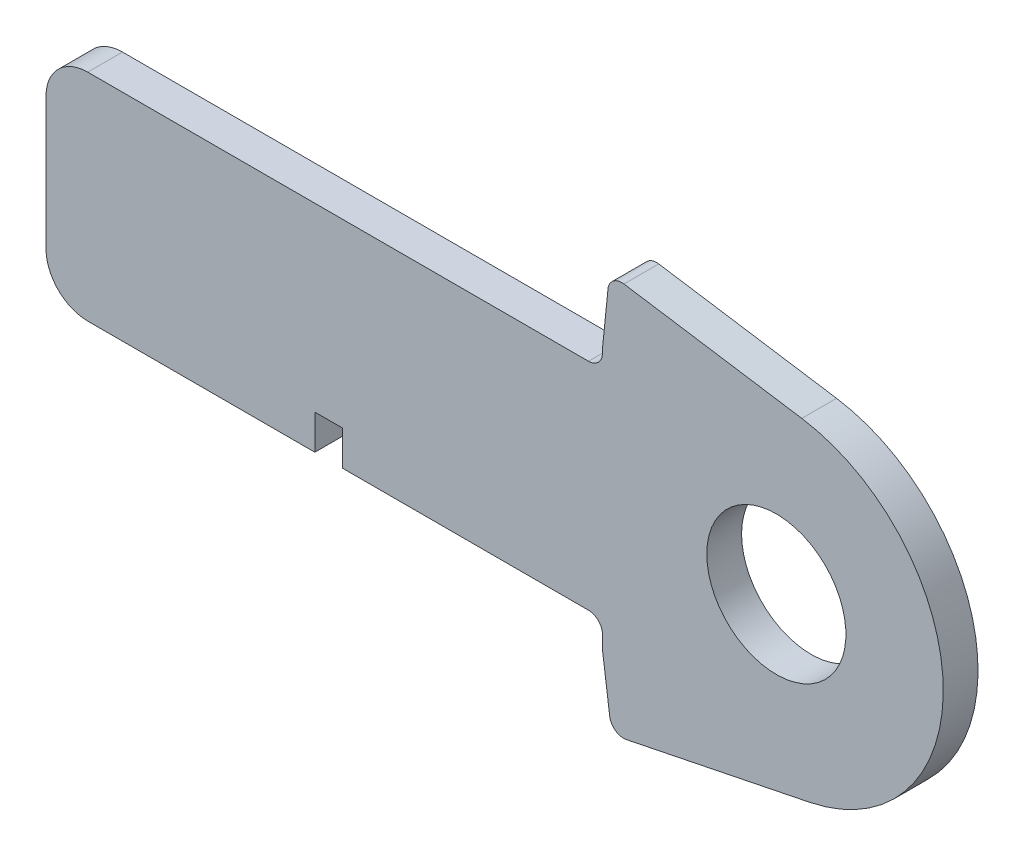
ISO-10303-21;
HEADER;
FILE_DESCRIPTION(('STEP AP214'),'2;1');
FILE_NAME('part.step','',(''),(''),'','','');
FILE_SCHEMA(('AUTOMOTIVE_DESIGN { 1 0 10303 214 1 1 1 1 }'));
ENDSEC;
DATA;
#1=APPLICATION_CONTEXT('core data for automotive mechanical design processes');
#2=APPLICATION_PROTOCOL_DEFINITION('international standard','automotive_design',2000,#1);
#3=PRODUCT_CONTEXT('',#1,'mechanical');
#4=PRODUCT('Part','Part','',(#3));
#5=PRODUCT_RELATED_PRODUCT_CATEGORY('part','',(#4));
#6=PRODUCT_DEFINITION_FORMATION('','',#4);
#7=PRODUCT_DEFINITION_CONTEXT('part definition',#1,'design');
#8=PRODUCT_DEFINITION('design','',#6,#7);
#9=PRODUCT_DEFINITION_SHAPE('','',#8);
#10=(LENGTH_UNIT() NAMED_UNIT(*) SI_UNIT(.MILLI.,.METRE.));
#11=(NAMED_UNIT(*) PLANE_ANGLE_UNIT() SI_UNIT($,.RADIAN.));
#12=(NAMED_UNIT(*) SI_UNIT($,.STERADIAN.) SOLID_ANGLE_UNIT());
#13=UNCERTAINTY_MEASURE_WITH_UNIT(LENGTH_MEASURE(1.E-05),#10,'distance_accuracy_value','');
#14=(GEOMETRIC_REPRESENTATION_CONTEXT(3) GLOBAL_UNCERTAINTY_ASSIGNED_CONTEXT((#13)) GLOBAL_UNIT_ASSIGNED_CONTEXT((#10,
#11,#12)) REPRESENTATION_CONTEXT('',''));
#15=CARTESIAN_POINT('',(0.,0.,0.));
#16=DIRECTION('',(0.,0.,1.));
#17=DIRECTION('',(1.,0.,0.));
#18=AXIS2_PLACEMENT_3D('',#15,#16,#17);
#19=CARTESIAN_POINT('',(213.422580288689,54.7287513036553,3.175));
#20=DIRECTION('',(0.,0.,-1.));
#21=DIRECTION('',(-1.,0.,0.));
#22=AXIS2_PLACEMENT_3D('',#19,#20,#21);
#23=PLANE('',#22);
#24=CARTESIAN_POINT('',(292.383806587551,26.255421434861,3.175));
#25=DIRECTION('',(0.,0.,-1.));
#26=DIRECTION('',(-1.,0.,0.));
#27=AXIS2_PLACEMENT_3D('',#24,#25,#26);
#28=CIRCLE('',#27,6.35);
#29=CARTESIAN_POINT('',(286.033806587551,26.255421434861,3.175));
#30=VERTEX_POINT('',#29);
#31=EDGE_CURVE('E281',#30,#30,#28,.T.);
#32=ORIENTED_EDGE('',*,*,#31,.T.);
#33=EDGE_LOOP('',(#32));
#34=FACE_BOUND('',#33,.T.);
#35=DIRECTION('',(-0.133331034869946,0.991071559041278,0.));
#36=VECTOR('',#35,1.);
#37=CARTESIAN_POINT('',(273.434595269181,36.7857570161253,3.175));
#38=LINE('',#37,#36);
#39=CARTESIAN_POINT('',(277.174368657139,8.98740499943636,3.175));
#40=VERTEX_POINT('',#39);
#41=CARTESIAN_POINT('',(276.508806587551,13.9346375667709,3.175));
#42=VERTEX_POINT('',#41);
#43=EDGE_CURVE('E232',#40,#42,#38,.T.);
#44=ORIENTED_EDGE('',*,*,#43,.F.);
#45=CARTESIAN_POINT('',(278.433029537121,9.15673541372118,3.175));
#46=DIRECTION('',(0.,0.,-1.));
#47=DIRECTION('',(-1.,0.,0.));
#48=AXIS2_PLACEMENT_3D('',#45,#46,#47);
#49=CIRCLE('',#48,1.27);
#50=CARTESIAN_POINT('',(278.686524593638,7.91229165994138,3.175));
#51=VERTEX_POINT('',#50);
#52=EDGE_CURVE('E307',#40,#51,#49,.F.);
#53=ORIENTED_EDGE('',*,*,#52,.T.);
#54=DIRECTION('',(0.979876971480177,0.199602406706023,0.));
#55=VECTOR('',#54,1.);
#56=CARTESIAN_POINT('',(9.55565157305778,-46.9100702664279,3.175));
#57=LINE('',#56,#55);
#58=CARTESIAN_POINT('',(295.425747265751,11.3220963895031,3.175));
#59=VERTEX_POINT('',#58);
#60=EDGE_CURVE('E230',#51,#59,#57,.T.);
#61=ORIENTED_EDGE('',*,*,#60,.T.);
#62=CARTESIAN_POINT('',(292.383806587551,26.255421434861,3.175));
#63=DIRECTION('',(0.,0.,1.));
#64=DIRECTION('',(1.,0.,0.));
#65=AXIS2_PLACEMENT_3D('',#62,#63,#64);
#66=CIRCLE('',#65,15.24);
#67=CARTESIAN_POINT('',(294.709258182036,41.3169577071576,3.175));
#68=VERTEX_POINT('',#67);
#69=EDGE_CURVE('E258',#59,#68,#66,.T.);
#70=ORIENTED_EDGE('',*,*,#69,.T.);
#71=DIRECTION('',(0.988289781646758,-0.152588687302186,0.));
#72=VECTOR('',#71,1.);
#73=CARTESIAN_POINT('',(13.0924795434369,84.7976608093711,3.175));
#74=LINE('',#73,#72);
#75=CARTESIAN_POINT('',(278.470624311763,43.824149293938,3.175));
#76=VERTEX_POINT('',#75);
#77=EDGE_CURVE('E256',#76,#68,#74,.T.);
#78=ORIENTED_EDGE('',*,*,#77,.F.);
#79=CARTESIAN_POINT('',(278.27683667889,42.5690212712466,3.175));
#80=DIRECTION('',(0.,0.,-1.));
#81=DIRECTION('',(-1.,0.,0.));
#82=AXIS2_PLACEMENT_3D('',#79,#80,#81);
#83=CIRCLE('',#82,1.27);
#84=CARTESIAN_POINT('',(277.013295568393,42.6969425833287,3.175));
#85=VERTEX_POINT('',#84);
#86=EDGE_CURVE('E305',#76,#85,#83,.F.);
#87=ORIENTED_EDGE('',*,*,#86,.T.);
#88=DIRECTION('',(0.10072544258434,0.994914260233609,0.));
#89=VECTOR('',#88,1.);
#90=CARTESIAN_POINT('',(269.924029023359,-27.3271962964349,3.175));
#91=LINE('',#90,#89);
#92=CARTESIAN_POINT('',(276.508806587551,37.7138591806421,3.175));
#93=VERTEX_POINT('',#92);
#94=EDGE_CURVE('E253',#93,#85,#91,.T.);
#95=ORIENTED_EDGE('',*,*,#94,.F.);
#96=DIRECTION('',(0.,1.,0.));
#97=VECTOR('',#96,1.);
#98=CARTESIAN_POINT('',(276.508806587551,0.,3.175));
#99=LINE('',#98,#97);
#100=CARTESIAN_POINT('',(276.508806587551,37.367921434861,3.175));
#101=VERTEX_POINT('',#100);
#102=EDGE_CURVE('E236',#101,#93,#99,.T.);
#103=ORIENTED_EDGE('',*,*,#102,.F.);
#104=CARTESIAN_POINT('',(275.238806587551,37.367921434861,3.175));
#105=DIRECTION('',(0.,0.,-1.));
#106=DIRECTION('',(-1.,0.,0.));
#107=AXIS2_PLACEMENT_3D('',#104,#105,#106);
#108=CIRCLE('',#107,1.27);
#109=CARTESIAN_POINT('',(275.238806587551,36.097921434861,3.175));
#110=VERTEX_POINT('',#109);
#111=EDGE_CURVE('E46',#101,#110,#108,.T.);
#112=ORIENTED_EDGE('',*,*,#111,.T.);
#113=DIRECTION('',(1.,0.,0.));
#114=VECTOR('',#113,1.);
#115=CARTESIAN_POINT('',(0.,36.097921434861,3.175));
#116=LINE('',#115,#114);
#117=CARTESIAN_POINT('',(229.518806587551,36.097921434861,3.175));
#118=VERTEX_POINT('',#117);
#119=EDGE_CURVE('E250',#118,#110,#116,.T.);
#120=ORIENTED_EDGE('',*,*,#119,.F.);
#121=CARTESIAN_POINT('',(229.518806587551,32.287921434861,3.175));
#122=DIRECTION('',(0.,0.,-1.));
#123=DIRECTION('',(-1.,0.,0.));
#124=AXIS2_PLACEMENT_3D('',#121,#122,#123);
#125=CIRCLE('',#124,3.81);
#126=CARTESIAN_POINT('',(225.708806587551,32.287921434861,3.175));
#127=VERTEX_POINT('',#126);
#128=EDGE_CURVE('E289',#118,#127,#125,.F.);
#129=ORIENTED_EDGE('',*,*,#128,.T.);
#130=DIRECTION('',(0.,-1.,0.));
#131=VECTOR('',#130,1.);
#132=CARTESIAN_POINT('',(225.708806587551,0.,3.175));
#133=LINE('',#132,#131);
#134=CARTESIAN_POINT('',(225.708806587551,20.222921434861,3.175));
#135=VERTEX_POINT('',#134);
#136=EDGE_CURVE('E247',#127,#135,#133,.T.);
#137=ORIENTED_EDGE('',*,*,#136,.T.);
#138=CARTESIAN_POINT('',(229.518806587551,20.222921434861,3.175));
#139=DIRECTION('',(0.,0.,-1.));
#140=DIRECTION('',(-1.,0.,0.));
#141=AXIS2_PLACEMENT_3D('',#138,#139,#140);
#142=CIRCLE('',#141,3.81);
#143=CARTESIAN_POINT('',(229.518806587551,16.412921434861,3.175));
#144=VERTEX_POINT('',#143);
#145=EDGE_CURVE('E291',#135,#144,#142,.F.);
#146=ORIENTED_EDGE('',*,*,#145,.T.);
#147=DIRECTION('',(1.,0.,0.));
#148=VECTOR('',#147,1.);
#149=CARTESIAN_POINT('',(0.,16.412921434861,3.175));
#150=LINE('',#149,#148);
#151=CARTESIAN_POINT('',(250.254440989192,16.412921434861,3.175));
#152=VERTEX_POINT('',#151);
#153=EDGE_CURVE('E239',#144,#152,#150,.T.);
#154=ORIENTED_EDGE('',*,*,#153,.T.);
#155=DIRECTION('',(0.,1.,0.));
#156=VECTOR('',#155,1.);
#157=CARTESIAN_POINT('',(250.254440989192,0.,3.175));
#158=LINE('',#157,#156);
#159=CARTESIAN_POINT('',(250.254440989192,19.587921434861,3.175));
#160=VERTEX_POINT('',#159);
#161=EDGE_CURVE('E244',#152,#160,#158,.T.);
#162=ORIENTED_EDGE('',*,*,#161,.T.);
#163=DIRECTION('',(1.,0.,0.));
#164=VECTOR('',#163,1.);
#165=CARTESIAN_POINT('',(0.,19.587921434861,3.175));
#166=LINE('',#165,#164);
#167=CARTESIAN_POINT('',(252.794440989192,19.587921434861,3.175));
#168=VERTEX_POINT('',#167);
#169=EDGE_CURVE('E241',#160,#168,#166,.T.);
#170=ORIENTED_EDGE('',*,*,#169,.T.);
#171=DIRECTION('',(0.,-1.,0.));
#172=VECTOR('',#171,1.);
#173=CARTESIAN_POINT('',(252.794440989192,0.,3.175));
#174=LINE('',#173,#172);
#175=CARTESIAN_POINT('',(252.794440989192,16.412921434861,3.175));
#176=VERTEX_POINT('',#175);
#177=EDGE_CURVE('E238',#168,#176,#174,.T.);
#178=ORIENTED_EDGE('',*,*,#177,.T.);
#179=CARTESIAN_POINT('',(275.238806587551,16.412921434861,3.175));
#180=VERTEX_POINT('',#179);
#181=EDGE_CURVE('E193',#176,#180,#150,.T.);
#182=ORIENTED_EDGE('',*,*,#181,.T.);
#183=CARTESIAN_POINT('',(275.238806587551,15.142921434861,3.175));
#184=DIRECTION('',(0.,0.,-1.));
#185=DIRECTION('',(-1.,0.,0.));
#186=AXIS2_PLACEMENT_3D('',#183,#184,#185);
#187=CIRCLE('',#186,1.27);
#188=CARTESIAN_POINT('',(276.508806587551,15.142921434861,3.175));
#189=VERTEX_POINT('',#188);
#190=EDGE_CURVE('E328',#180,#189,#187,.T.);
#191=ORIENTED_EDGE('',*,*,#190,.T.);
#192=EDGE_CURVE('E234',#42,#189,#99,.T.);
#193=ORIENTED_EDGE('',*,*,#192,.F.);
#194=EDGE_LOOP('',(#44,#53,#61,#70,#78,#87,#95,#103,#112,#120,#129,#137,#146,#154,#162,#170,
#178,#182,#191,#193));
#195=FACE_BOUND('',#194,.T.);
#196=ADVANCED_FACE('F38',(#34,#195),#23,.F.);
#197=CARTESIAN_POINT('',(213.422580288689,54.7287513036553,0.));
#198=DIRECTION('',(0.,0.,-1.));
#199=DIRECTION('',(-1.,0.,0.));
#200=AXIS2_PLACEMENT_3D('',#197,#198,#199);
#201=PLANE('',#200);
#202=CARTESIAN_POINT('',(292.383806587551,26.255421434861,0.));
#203=DIRECTION('',(0.,0.,-1.));
#204=DIRECTION('',(-1.,0.,0.));
#205=AXIS2_PLACEMENT_3D('',#202,#203,#204);
#206=CIRCLE('',#205,6.35);
#207=CARTESIAN_POINT('',(286.033806587551,26.255421434861,0.));
#208=VERTEX_POINT('',#207);
#209=EDGE_CURVE('E265',#208,#208,#206,.T.);
#210=ORIENTED_EDGE('',*,*,#209,.F.);
#211=EDGE_LOOP('',(#210));
#212=FACE_BOUND('',#211,.T.);
#213=DIRECTION('',(0.979876971480177,0.199602406706023,0.));
#214=VECTOR('',#213,1.);
#215=CARTESIAN_POINT('',(9.55565157305778,-46.9100702664279,0.));
#216=LINE('',#215,#214);
#217=CARTESIAN_POINT('',(278.686524593638,7.91229165994138,0.));
#218=VERTEX_POINT('',#217);
#219=CARTESIAN_POINT('',(295.425747265751,11.3220963895031,0.));
#220=VERTEX_POINT('',#219);
#221=EDGE_CURVE('E261',#218,#220,#216,.T.);
#222=ORIENTED_EDGE('',*,*,#221,.F.);
#223=CARTESIAN_POINT('',(278.433029537121,9.15673541372118,0.));
#224=DIRECTION('',(0.,0.,-1.));
#225=DIRECTION('',(-1.,0.,0.));
#226=AXIS2_PLACEMENT_3D('',#223,#224,#225);
#227=CIRCLE('',#226,1.27);
#228=CARTESIAN_POINT('',(277.174368657139,8.98740499943636,0.));
#229=VERTEX_POINT('',#228);
#230=EDGE_CURVE('E313',#218,#229,#227,.T.);
#231=ORIENTED_EDGE('',*,*,#230,.T.);
#232=DIRECTION('',(-0.133331034869946,0.991071559041278,0.));
#233=VECTOR('',#232,1.);
#234=CARTESIAN_POINT('',(273.434595269181,36.7857570161253,0.));
#235=LINE('',#234,#233);
#236=CARTESIAN_POINT('',(276.508806587551,13.9346375667709,0.));
#237=VERTEX_POINT('',#236);
#238=EDGE_CURVE('E202',#229,#237,#235,.T.);
#239=ORIENTED_EDGE('',*,*,#238,.T.);
#240=DIRECTION('',(0.,1.,0.));
#241=VECTOR('',#240,1.);
#242=CARTESIAN_POINT('',(276.508806587551,0.,0.));
#243=LINE('',#242,#241);
#244=CARTESIAN_POINT('',(276.508806587551,15.142921434861,0.));
#245=VERTEX_POINT('',#244);
#246=EDGE_CURVE('E199',#237,#245,#243,.T.);
#247=ORIENTED_EDGE('',*,*,#246,.T.);
#248=CARTESIAN_POINT('',(275.238806587551,15.142921434861,0.));
#249=DIRECTION('',(0.,0.,-1.));
#250=DIRECTION('',(-1.,0.,0.));
#251=AXIS2_PLACEMENT_3D('',#248,#249,#250);
#252=CIRCLE('',#251,1.27);
#253=CARTESIAN_POINT('',(275.238806587551,16.412921434861,0.));
#254=VERTEX_POINT('',#253);
#255=EDGE_CURVE('E53',#245,#254,#252,.F.);
#256=ORIENTED_EDGE('',*,*,#255,.T.);
#257=DIRECTION('',(1.,0.,0.));
#258=VECTOR('',#257,1.);
#259=CARTESIAN_POINT('',(0.,16.412921434861,0.));
#260=LINE('',#259,#258);
#261=CARTESIAN_POINT('',(252.794440989192,16.412921434861,0.));
#262=VERTEX_POINT('',#261);
#263=EDGE_CURVE('E186',#262,#254,#260,.T.);
#264=ORIENTED_EDGE('',*,*,#263,.F.);
#265=DIRECTION('',(0.,-1.,0.));
#266=VECTOR('',#265,1.);
#267=CARTESIAN_POINT('',(252.794440989192,0.,0.));
#268=LINE('',#267,#266);
#269=CARTESIAN_POINT('',(252.794440989192,19.587921434861,0.));
#270=VERTEX_POINT('',#269);
#271=EDGE_CURVE('E177',#270,#262,#268,.T.);
#272=ORIENTED_EDGE('',*,*,#271,.F.);
#273=DIRECTION('',(1.,0.,0.));
#274=VECTOR('',#273,1.);
#275=CARTESIAN_POINT('',(0.,19.587921434861,0.));
#276=LINE('',#275,#274);
#277=CARTESIAN_POINT('',(250.254440989192,19.587921434861,0.));
#278=VERTEX_POINT('',#277);
#279=EDGE_CURVE('E185',#278,#270,#276,.T.);
#280=ORIENTED_EDGE('',*,*,#279,.F.);
#281=DIRECTION('',(0.,1.,0.));
#282=VECTOR('',#281,1.);
#283=CARTESIAN_POINT('',(250.254440989192,0.,0.));
#284=LINE('',#283,#282);
#285=CARTESIAN_POINT('',(250.254440989192,16.412921434861,0.));
#286=VERTEX_POINT('',#285);
#287=EDGE_CURVE('E206',#286,#278,#284,.T.);
#288=ORIENTED_EDGE('',*,*,#287,.F.);
#289=CARTESIAN_POINT('',(229.518806587551,16.412921434861,0.));
#290=VERTEX_POINT('',#289);
#291=EDGE_CURVE('E201',#290,#286,#260,.T.);
#292=ORIENTED_EDGE('',*,*,#291,.F.);
#293=CARTESIAN_POINT('',(229.518806587551,20.222921434861,0.));
#294=DIRECTION('',(0.,0.,-1.));
#295=DIRECTION('',(-1.,0.,0.));
#296=AXIS2_PLACEMENT_3D('',#293,#294,#295);
#297=CIRCLE('',#296,3.81);
#298=CARTESIAN_POINT('',(225.708806587551,20.222921434861,0.));
#299=VERTEX_POINT('',#298);
#300=EDGE_CURVE('E297',#290,#299,#297,.T.);
#301=ORIENTED_EDGE('',*,*,#300,.T.);
#302=DIRECTION('',(0.,-1.,0.));
#303=VECTOR('',#302,1.);
#304=CARTESIAN_POINT('',(225.708806587551,0.,0.));
#305=LINE('',#304,#303);
#306=CARTESIAN_POINT('',(225.708806587551,32.287921434861,0.));
#307=VERTEX_POINT('',#306);
#308=EDGE_CURVE('E205',#307,#299,#305,.T.);
#309=ORIENTED_EDGE('',*,*,#308,.F.);
#310=CARTESIAN_POINT('',(229.518806587551,32.287921434861,0.));
#311=DIRECTION('',(0.,0.,-1.));
#312=DIRECTION('',(-1.,0.,0.));
#313=AXIS2_PLACEMENT_3D('',#310,#311,#312);
#314=CIRCLE('',#313,3.81);
#315=CARTESIAN_POINT('',(229.518806587551,36.097921434861,0.));
#316=VERTEX_POINT('',#315);
#317=EDGE_CURVE('E295',#307,#316,#314,.T.);
#318=ORIENTED_EDGE('',*,*,#317,.T.);
#319=DIRECTION('',(1.,0.,0.));
#320=VECTOR('',#319,1.);
#321=CARTESIAN_POINT('',(0.,36.097921434861,0.));
#322=LINE('',#321,#320);
#323=CARTESIAN_POINT('',(275.238806587551,36.097921434861,0.));
#324=VERTEX_POINT('',#323);
#325=EDGE_CURVE('E212',#316,#324,#322,.T.);
#326=ORIENTED_EDGE('',*,*,#325,.T.);
#327=CARTESIAN_POINT('',(275.238806587551,37.367921434861,0.));
#328=DIRECTION('',(0.,0.,-1.));
#329=DIRECTION('',(-1.,0.,0.));
#330=AXIS2_PLACEMENT_3D('',#327,#328,#329);
#331=CIRCLE('',#330,1.27);
#332=CARTESIAN_POINT('',(276.508806587551,37.367921434861,0.));
#333=VERTEX_POINT('',#332);
#334=EDGE_CURVE('E11',#324,#333,#331,.F.);
#335=ORIENTED_EDGE('',*,*,#334,.T.);
#336=CARTESIAN_POINT('',(276.508806587551,37.7138591806421,0.));
#337=VERTEX_POINT('',#336);
#338=EDGE_CURVE('E204',#333,#337,#243,.T.);
#339=ORIENTED_EDGE('',*,*,#338,.T.);
#340=DIRECTION('',(0.10072544258434,0.994914260233609,0.));
#341=VECTOR('',#340,1.);
#342=CARTESIAN_POINT('',(269.924029023359,-27.3271962964349,0.));
#343=LINE('',#342,#341);
#344=CARTESIAN_POINT('',(277.013295568393,42.6969425833287,0.));
#345=VERTEX_POINT('',#344);
#346=EDGE_CURVE('E222',#337,#345,#343,.T.);
#347=ORIENTED_EDGE('',*,*,#346,.T.);
#348=CARTESIAN_POINT('',(278.27683667889,42.5690212712466,0.));
#349=DIRECTION('',(0.,0.,-1.));
#350=DIRECTION('',(-1.,0.,0.));
#351=AXIS2_PLACEMENT_3D('',#348,#349,#350);
#352=CIRCLE('',#351,1.27);
#353=CARTESIAN_POINT('',(278.470624311763,43.824149293938,0.));
#354=VERTEX_POINT('',#353);
#355=EDGE_CURVE('E311',#345,#354,#352,.T.);
#356=ORIENTED_EDGE('',*,*,#355,.T.);
#357=DIRECTION('',(0.988289781646758,-0.152588687302186,0.));
#358=VECTOR('',#357,1.);
#359=CARTESIAN_POINT('',(13.0924795434369,84.7976608093711,0.));
#360=LINE('',#359,#358);
#361=CARTESIAN_POINT('',(294.709258182036,41.3169577071576,0.));
#362=VERTEX_POINT('',#361);
#363=EDGE_CURVE('E225',#354,#362,#360,.T.);
#364=ORIENTED_EDGE('',*,*,#363,.T.);
#365=CARTESIAN_POINT('',(292.383806587551,26.255421434861,0.));
#366=DIRECTION('',(0.,0.,1.));
#367=DIRECTION('',(1.,0.,0.));
#368=AXIS2_PLACEMENT_3D('',#365,#366,#367);
#369=CIRCLE('',#368,15.24);
#370=EDGE_CURVE('E227',#220,#362,#369,.T.);
#371=ORIENTED_EDGE('',*,*,#370,.F.);
#372=EDGE_LOOP('',(#222,#231,#239,#247,#256,#264,#272,#280,#288,#292,#301,#309,#318,#326,#335,
#339,#347,#356,#364,#371));
#373=FACE_BOUND('',#372,.T.);
#374=ADVANCED_FACE('F198',(#212,#373),#201,.T.);
#375=CARTESIAN_POINT('',(292.383806587551,26.255421434861,7.62));
#376=DIRECTION('',(0.,0.,-1.));
#377=DIRECTION('',(-1.,0.,0.));
#378=AXIS2_PLACEMENT_3D('',#375,#376,#377);
#379=CYLINDRICAL_SURFACE('',#378,6.35);
#380=CARTESIAN_POINT('',(286.033806587551,26.255421434861,0.));
#381=CARTESIAN_POINT('',(286.033806587551,26.255421434861,0.0330729166666668));
#382=CARTESIAN_POINT('',(286.033806587551,26.255421434861,0.0661458333333336));
#383=CARTESIAN_POINT('',(286.033806587551,26.255421434861,0.132291666666667));
#384=CARTESIAN_POINT('',(286.033806587551,26.255421434861,0.165364583333333));
#385=CARTESIAN_POINT('',(286.033806587551,26.255421434861,0.231510416666667));
#386=CARTESIAN_POINT('',(286.033806587551,26.255421434861,0.264583333333333));
#387=CARTESIAN_POINT('',(286.033806587551,26.255421434861,0.330729166666667));
#388=CARTESIAN_POINT('',(286.033806587551,26.255421434861,0.363802083333333));
#389=CARTESIAN_POINT('',(286.033806587551,26.255421434861,0.429947916666666));
#390=CARTESIAN_POINT('',(286.033806587551,26.255421434861,0.463020833333333));
#391=CARTESIAN_POINT('',(286.033806587551,26.255421434861,0.529166666666667));
#392=CARTESIAN_POINT('',(286.033806587551,26.255421434861,0.562239583333334));
#393=CARTESIAN_POINT('',(286.033806587551,26.255421434861,0.628385416666667));
#394=CARTESIAN_POINT('',(286.033806587551,26.255421434861,0.661458333333333));
#395=CARTESIAN_POINT('',(286.033806587551,26.255421434861,0.727604166666667));
#396=CARTESIAN_POINT('',(286.033806587551,26.255421434861,0.760677083333334));
#397=CARTESIAN_POINT('',(286.033806587551,26.255421434861,0.826822916666667));
#398=CARTESIAN_POINT('',(286.033806587551,26.255421434861,0.859895833333334));
#399=CARTESIAN_POINT('',(286.033806587551,26.255421434861,0.926041666666667));
#400=CARTESIAN_POINT('',(286.033806587551,26.255421434861,0.959114583333334));
#401=CARTESIAN_POINT('',(286.033806587551,26.255421434861,1.02526041666667));
#402=CARTESIAN_POINT('',(286.033806587551,26.255421434861,1.05833333333333));
#403=CARTESIAN_POINT('',(286.033806587551,26.255421434861,1.12447916666667));
#404=CARTESIAN_POINT('',(286.033806587551,26.255421434861,1.15755208333333));
#405=CARTESIAN_POINT('',(286.033806587551,26.255421434861,1.22369791666667));
#406=CARTESIAN_POINT('',(286.033806587551,26.255421434861,1.25677083333333));
#407=CARTESIAN_POINT('',(286.033806587551,26.255421434861,1.32291666666667));
#408=CARTESIAN_POINT('',(286.033806587551,26.255421434861,1.35598958333333));
#409=CARTESIAN_POINT('',(286.033806587551,26.255421434861,1.42213541666667));
#410=CARTESIAN_POINT('',(286.033806587551,26.255421434861,1.45520833333333));
#411=CARTESIAN_POINT('',(286.033806587551,26.255421434861,1.52135416666667));
#412=CARTESIAN_POINT('',(286.033806587551,26.255421434861,1.55442708333333));
#413=CARTESIAN_POINT('',(286.033806587551,26.255421434861,1.62057291666667));
#414=CARTESIAN_POINT('',(286.033806587551,26.255421434861,1.65364583333333));
#415=CARTESIAN_POINT('',(286.033806587551,26.255421434861,1.71979166666667));
#416=CARTESIAN_POINT('',(286.033806587551,26.255421434861,1.75286458333333));
#417=CARTESIAN_POINT('',(286.033806587551,26.255421434861,1.81901041666667));
#418=CARTESIAN_POINT('',(286.033806587551,26.255421434861,1.85208333333333));
#419=CARTESIAN_POINT('',(286.033806587551,26.255421434861,1.91822916666667));
#420=CARTESIAN_POINT('',(286.033806587551,26.255421434861,1.95130208333333));
#421=CARTESIAN_POINT('',(286.033806587551,26.255421434861,2.01744791666667));
#422=CARTESIAN_POINT('',(286.033806587551,26.255421434861,2.05052083333333));
#423=CARTESIAN_POINT('',(286.033806587551,26.255421434861,2.11666666666667));
#424=CARTESIAN_POINT('',(286.033806587551,26.255421434861,2.14973958333333));
#425=CARTESIAN_POINT('',(286.033806587551,26.255421434861,2.21588541666667));
#426=CARTESIAN_POINT('',(286.033806587551,26.255421434861,2.24895833333333));
#427=CARTESIAN_POINT('',(286.033806587551,26.255421434861,2.31510416666667));
#428=CARTESIAN_POINT('',(286.033806587551,26.255421434861,2.34817708333333));
#429=CARTESIAN_POINT('',(286.033806587551,26.255421434861,2.41432291666667));
#430=CARTESIAN_POINT('',(286.033806587551,26.255421434861,2.44739583333333));
#431=CARTESIAN_POINT('',(286.033806587551,26.255421434861,2.51354166666667));
#432=CARTESIAN_POINT('',(286.033806587551,26.255421434861,2.54661458333333));
#433=CARTESIAN_POINT('',(286.033806587551,26.255421434861,2.61276041666667));
#434=CARTESIAN_POINT('',(286.033806587551,26.255421434861,2.64583333333333));
#435=CARTESIAN_POINT('',(286.033806587551,26.255421434861,2.71197916666667));
#436=CARTESIAN_POINT('',(286.033806587551,26.255421434861,2.74505208333333));
#437=CARTESIAN_POINT('',(286.033806587551,26.255421434861,2.81119791666667));
#438=CARTESIAN_POINT('',(286.033806587551,26.255421434861,2.84427083333333));
#439=CARTESIAN_POINT('',(286.033806587551,26.255421434861,2.91041666666667));
#440=CARTESIAN_POINT('',(286.033806587551,26.255421434861,2.94348958333333));
#441=CARTESIAN_POINT('',(286.033806587551,26.255421434861,3.00963541666667));
#442=CARTESIAN_POINT('',(286.033806587551,26.255421434861,3.04270833333333));
#443=CARTESIAN_POINT('',(286.033806587551,26.255421434861,3.10885416666667));
#444=CARTESIAN_POINT('',(286.033806587551,26.255421434861,3.14192708333333));
#445=CARTESIAN_POINT('',(286.033806587551,26.255421434861,3.175));
#446=B_SPLINE_CURVE_WITH_KNOTS('',3,(#380,#381,#382,#383,#384,#385,#386,#387,#388,#389,#390,
#391,#392,#393,#394,#395,#396,#397,#398,#399,#400,#401,#402,#403,#404,#405,#406,#407,#408,#409,
#410,#411,#412,#413,#414,#415,#416,#417,#418,#419,#420,#421,#422,#423,#424,#425,#426,#427,#428,
#429,#430,#431,#432,#433,#434,#435,#436,#437,#438,#439,#440,#441,#442,#443,#444,#445),
.UNSPECIFIED.,.F.,.F.,(4,2,2,2,2,2,2,2,2,2,2,2,2,2,2,2,2,2,2,2,2,2,2,2,2,2,2,2,2,2,2,2,4),(0.,
0.0992187500000004,0.1984375,0.29765625,0.396875,0.49609375,0.5953125,0.69453125,0.79375,
0.892968750000001,0.9921875,1.09140625,1.190625,1.28984375,1.3890625,1.48828125,1.5875,
1.68671875,1.7859375,1.88515625,1.984375,2.08359375,2.1828125,2.28203125,2.38125,2.48046875,
2.5796875,2.67890625,2.778125,2.87734375,2.9765625,3.07578125,3.175),.UNSPECIFIED.);
#447=EDGE_CURVE('BSEAM387',#208,#30,#446,.T.);
#448=ORIENTED_EDGE('',*,*,#209,.T.);
#449=ORIENTED_EDGE('',*,*,#31,.F.);
#450=ORIENTED_EDGE('',*,*,#447,.T.);
#451=ORIENTED_EDGE('',*,*,#447,.F.);
#452=EDGE_LOOP('',(#448,#450,#449,#451));
#453=FACE_BOUND('',#452,.T.);
#454=ADVANCED_FACE('F387',(#453),#379,.F.);
#455=CARTESIAN_POINT('',(9.55565157305778,-46.9100702664279,0.));
#456=DIRECTION('',(0.199602406706023,-0.979876971480177,0.));
#457=DIRECTION('',(0.979876971480177,0.199602406706023,0.));
#458=AXIS2_PLACEMENT_3D('',#455,#456,#457);
#459=PLANE('',#458);
#460=ORIENTED_EDGE('',*,*,#60,.F.);
#461=DIRECTION('',(0.,0.,1.));
#462=VECTOR('',#461,1.);
#463=CARTESIAN_POINT('',(278.686524593638,7.91229165994136,0.));
#464=LINE('',#463,#462);
#465=EDGE_CURVE('E309',#51,#218,#464,.F.);
#466=ORIENTED_EDGE('',*,*,#465,.T.);
#467=ORIENTED_EDGE('',*,*,#221,.T.);
#468=DIRECTION('',(0.,0.,1.));
#469=VECTOR('',#468,1.);
#470=CARTESIAN_POINT('',(295.425747265751,11.3220963895031,0.));
#471=LINE('',#470,#469);
#472=EDGE_CURVE('E262',#220,#59,#471,.T.);
#473=ORIENTED_EDGE('',*,*,#472,.T.);
#474=EDGE_LOOP('',(#460,#466,#467,#473));
#475=FACE_BOUND('',#474,.T.);
#476=ADVANCED_FACE('F353',(#475),#459,.T.);
#477=CARTESIAN_POINT('',(292.383806587551,26.255421434861,0.));
#478=DIRECTION('',(0.,0.,1.));
#479=DIRECTION('',(1.,0.,0.));
#480=AXIS2_PLACEMENT_3D('',#477,#478,#479);
#481=CYLINDRICAL_SURFACE('',#480,15.24);
#482=ORIENTED_EDGE('',*,*,#69,.F.);
#483=ORIENTED_EDGE('',*,*,#472,.F.);
#484=ORIENTED_EDGE('',*,*,#370,.T.);
#485=DIRECTION('',(0.,0.,1.));
#486=VECTOR('',#485,1.);
#487=CARTESIAN_POINT('',(294.709258182036,41.3169577071576,0.));
#488=LINE('',#487,#486);
#489=EDGE_CURVE('E266',#362,#68,#488,.T.);
#490=ORIENTED_EDGE('',*,*,#489,.T.);
#491=EDGE_LOOP('',(#482,#483,#484,#490));
#492=FACE_BOUND('',#491,.T.);
#493=ADVANCED_FACE('F359',(#492),#481,.T.);
#494=CARTESIAN_POINT('',(13.0924795434369,84.7976608093711,0.));
#495=DIRECTION('',(-0.152588687302185,-0.988289781646758,0.));
#496=DIRECTION('',(0.988289781646758,-0.152588687302186,0.));
#497=AXIS2_PLACEMENT_3D('',#494,#495,#496);
#498=PLANE('',#497);
#499=ORIENTED_EDGE('',*,*,#363,.F.);
#500=DIRECTION('',(0.,0.,1.));
#501=VECTOR('',#500,1.);
#502=CARTESIAN_POINT('',(278.470624311763,43.824149293938,0.));
#503=LINE('',#502,#501);
#504=EDGE_CURVE('E315',#354,#76,#503,.T.);
#505=ORIENTED_EDGE('',*,*,#504,.T.);
#506=ORIENTED_EDGE('',*,*,#77,.T.);
#507=ORIENTED_EDGE('',*,*,#489,.F.);
#508=EDGE_LOOP('',(#499,#505,#506,#507));
#509=FACE_BOUND('',#508,.T.);
#510=ADVANCED_FACE('F365',(#509),#498,.F.);
#511=CARTESIAN_POINT('',(269.924029023359,-27.3271962964349,0.));
#512=DIRECTION('',(0.994914260233609,-0.10072544258434,0.));
#513=DIRECTION('',(0.10072544258434,0.994914260233609,0.));
#514=AXIS2_PLACEMENT_3D('',#511,#512,#513);
#515=PLANE('',#514);
#516=ORIENTED_EDGE('',*,*,#94,.T.);
#517=DIRECTION('',(0.,0.,1.));
#518=VECTOR('',#517,1.);
#519=CARTESIAN_POINT('',(277.013295568393,42.6969425833287,0.));
#520=LINE('',#519,#518);
#521=EDGE_CURVE('E318',#85,#345,#520,.F.);
#522=ORIENTED_EDGE('',*,*,#521,.T.);
#523=ORIENTED_EDGE('',*,*,#346,.F.);
#524=DIRECTION('',(0.,0.,1.));
#525=VECTOR('',#524,1.);
#526=CARTESIAN_POINT('',(276.508806587551,37.7138591806421,0.));
#527=LINE('',#526,#525);
#528=EDGE_CURVE('E269',#337,#93,#527,.T.);
#529=ORIENTED_EDGE('',*,*,#528,.T.);
#530=EDGE_LOOP('',(#516,#522,#523,#529));
#531=FACE_BOUND('',#530,.T.);
#532=ADVANCED_FACE('F371',(#531),#515,.F.);
#533=CARTESIAN_POINT('',(276.508806587551,0.,0.));
#534=DIRECTION('',(1.,0.,0.));
#535=DIRECTION('',(0.,0.,-1.));
#536=AXIS2_PLACEMENT_3D('',#533,#534,#535);
#537=PLANE('',#536);
#538=ORIENTED_EDGE('',*,*,#338,.F.);
#539=DIRECTION('',(0.,0.,1.));
#540=VECTOR('',#539,1.);
#541=CARTESIAN_POINT('',(276.508806587551,37.367921434861,3.175));
#542=LINE('',#541,#540);
#543=EDGE_CURVE('E323',#333,#101,#542,.T.);
#544=ORIENTED_EDGE('',*,*,#543,.T.);
#545=ORIENTED_EDGE('',*,*,#102,.T.);
#546=ORIENTED_EDGE('',*,*,#528,.F.);
#547=EDGE_LOOP('',(#538,#544,#545,#546));
#548=FACE_BOUND('',#547,.T.);
#549=ADVANCED_FACE('F346',(#548),#537,.F.);
#550=CARTESIAN_POINT('',(0.,36.097921434861,0.));
#551=DIRECTION('',(0.,-1.,0.));
#552=DIRECTION('',(0.,0.,-1.));
#553=AXIS2_PLACEMENT_3D('',#550,#551,#552);
#554=PLANE('',#553);
#555=ORIENTED_EDGE('',*,*,#119,.T.);
#556=DIRECTION('',(0.,0.,1.));
#557=VECTOR('',#556,1.);
#558=CARTESIAN_POINT('',(275.238806587551,36.097921434861,0.));
#559=LINE('',#558,#557);
#560=EDGE_CURVE('E326',#110,#324,#559,.F.);
#561=ORIENTED_EDGE('',*,*,#560,.T.);
#562=ORIENTED_EDGE('',*,*,#325,.F.);
#563=DIRECTION('',(0.,0.,1.));
#564=VECTOR('',#563,1.);
#565=CARTESIAN_POINT('',(229.518806587551,36.097921434861,3.175));
#566=LINE('',#565,#564);
#567=EDGE_CURVE('E299',#316,#118,#566,.T.);
#568=ORIENTED_EDGE('',*,*,#567,.T.);
#569=EDGE_LOOP('',(#555,#561,#562,#568));
#570=FACE_BOUND('',#569,.T.);
#571=ADVANCED_FACE('F339',(#570),#554,.F.);
#572=CARTESIAN_POINT('',(225.708806587551,0.,0.));
#573=DIRECTION('',(-1.,0.,0.));
#574=DIRECTION('',(0.,0.,1.));
#575=AXIS2_PLACEMENT_3D('',#572,#573,#574);
#576=PLANE('',#575);
#577=ORIENTED_EDGE('',*,*,#308,.T.);
#578=DIRECTION('',(0.,0.,1.));
#579=VECTOR('',#578,1.);
#580=CARTESIAN_POINT('',(225.708806587551,20.222921434861,0.));
#581=LINE('',#580,#579);
#582=EDGE_CURVE('E286',#299,#135,#581,.T.);
#583=ORIENTED_EDGE('',*,*,#582,.T.);
#584=ORIENTED_EDGE('',*,*,#136,.F.);
#585=DIRECTION('',(0.,0.,1.));
#586=VECTOR('',#585,1.);
#587=CARTESIAN_POINT('',(225.708806587551,32.287921434861,0.));
#588=LINE('',#587,#586);
#589=EDGE_CURVE('E284',#127,#307,#588,.F.);
#590=ORIENTED_EDGE('',*,*,#589,.T.);
#591=EDGE_LOOP('',(#577,#583,#584,#590));
#592=FACE_BOUND('',#591,.T.);
#593=ADVANCED_FACE('F424',(#592),#576,.T.);
#594=CARTESIAN_POINT('',(0.,16.412921434861,0.));
#595=DIRECTION('',(0.,-1.,0.));
#596=DIRECTION('',(1.,0.,0.));
#597=AXIS2_PLACEMENT_3D('',#594,#595,#596);
#598=PLANE('',#597);
#599=ORIENTED_EDGE('',*,*,#153,.F.);
#600=DIRECTION('',(0.,0.,1.));
#601=VECTOR('',#600,1.);
#602=CARTESIAN_POINT('',(229.518806587551,16.412921434861,0.));
#603=LINE('',#602,#601);
#604=EDGE_CURVE('E293',#144,#290,#603,.F.);
#605=ORIENTED_EDGE('',*,*,#604,.T.);
#606=ORIENTED_EDGE('',*,*,#291,.T.);
#607=DIRECTION('',(0.,0.,1.));
#608=VECTOR('',#607,1.);
#609=CARTESIAN_POINT('',(250.254440989192,16.412921434861,0.));
#610=LINE('',#609,#608);
#611=EDGE_CURVE('E272',#286,#152,#610,.T.);
#612=ORIENTED_EDGE('',*,*,#611,.T.);
#613=EDGE_LOOP('',(#599,#605,#606,#612));
#614=FACE_BOUND('',#613,.T.);
#615=ADVANCED_FACE('F428',(#614),#598,.T.);
#616=CARTESIAN_POINT('',(250.254440989192,0.,0.));
#617=DIRECTION('',(1.,0.,0.));
#618=DIRECTION('',(0.,0.,-1.));
#619=AXIS2_PLACEMENT_3D('',#616,#617,#618);
#620=PLANE('',#619);
#621=ORIENTED_EDGE('',*,*,#161,.F.);
#622=ORIENTED_EDGE('',*,*,#611,.F.);
#623=ORIENTED_EDGE('',*,*,#287,.T.);
#624=DIRECTION('',(0.,0.,1.));
#625=VECTOR('',#624,1.);
#626=CARTESIAN_POINT('',(250.254440989192,19.587921434861,0.));
#627=LINE('',#626,#625);
#628=EDGE_CURVE('E274',#278,#160,#627,.T.);
#629=ORIENTED_EDGE('',*,*,#628,.T.);
#630=EDGE_LOOP('',(#621,#622,#623,#629));
#631=FACE_BOUND('',#630,.T.);
#632=ADVANCED_FACE('F429',(#631),#620,.T.);
#633=CARTESIAN_POINT('',(0.,19.587921434861,0.));
#634=DIRECTION('',(0.,-1.,0.));
#635=DIRECTION('',(0.,0.,-1.));
#636=AXIS2_PLACEMENT_3D('',#633,#634,#635);
#637=PLANE('',#636);
#638=ORIENTED_EDGE('',*,*,#169,.F.);
#639=ORIENTED_EDGE('',*,*,#628,.F.);
#640=ORIENTED_EDGE('',*,*,#279,.T.);
#641=DIRECTION('',(0.,0.,1.));
#642=VECTOR('',#641,1.);
#643=CARTESIAN_POINT('',(252.794440989192,19.587921434861,0.));
#644=LINE('',#643,#642);
#645=EDGE_CURVE('E183',#270,#168,#644,.T.);
#646=ORIENTED_EDGE('',*,*,#645,.T.);
#647=EDGE_LOOP('',(#638,#639,#640,#646));
#648=FACE_BOUND('',#647,.T.);
#649=ADVANCED_FACE('F417',(#648),#637,.T.);
#650=CARTESIAN_POINT('',(252.794440989192,0.,0.));
#651=DIRECTION('',(-1.,0.,0.));
#652=DIRECTION('',(0.,0.,1.));
#653=AXIS2_PLACEMENT_3D('',#650,#651,#652);
#654=PLANE('',#653);
#655=ORIENTED_EDGE('',*,*,#177,.F.);
#656=ORIENTED_EDGE('',*,*,#645,.F.);
#657=ORIENTED_EDGE('',*,*,#271,.T.);
#658=DIRECTION('',(0.,0.,1.));
#659=VECTOR('',#658,1.);
#660=CARTESIAN_POINT('',(252.794440989192,16.412921434861,0.));
#661=LINE('',#660,#659);
#662=EDGE_CURVE('E181',#262,#176,#661,.T.);
#663=ORIENTED_EDGE('',*,*,#662,.T.);
#664=EDGE_LOOP('',(#655,#656,#657,#663));
#665=FACE_BOUND('',#664,.T.);
#666=ADVANCED_FACE('F180',(#665),#654,.T.);
#667=ORIENTED_EDGE('',*,*,#263,.T.);
#668=DIRECTION('',(0.,0.,1.));
#669=VECTOR('',#668,1.);
#670=CARTESIAN_POINT('',(275.238806587551,16.412921434861,0.));
#671=LINE('',#670,#669);
#672=EDGE_CURVE('E320',#254,#180,#671,.T.);
#673=ORIENTED_EDGE('',*,*,#672,.T.);
#674=ORIENTED_EDGE('',*,*,#181,.F.);
#675=ORIENTED_EDGE('',*,*,#662,.F.);
#676=EDGE_LOOP('',(#667,#673,#674,#675));
#677=FACE_BOUND('',#676,.T.);
#678=ADVANCED_FACE('F189',(#677),#598,.T.);
#679=ORIENTED_EDGE('',*,*,#192,.T.);
#680=DIRECTION('',(0.,0.,1.));
#681=VECTOR('',#680,1.);
#682=CARTESIAN_POINT('',(276.508806587551,15.142921434861,0.));
#683=LINE('',#682,#681);
#684=EDGE_CURVE('E61',#189,#245,#683,.F.);
#685=ORIENTED_EDGE('',*,*,#684,.T.);
#686=ORIENTED_EDGE('',*,*,#246,.F.);
#687=DIRECTION('',(0.,0.,1.));
#688=VECTOR('',#687,1.);
#689=CARTESIAN_POINT('',(276.508806587551,13.9346375667709,0.));
#690=LINE('',#689,#688);
#691=EDGE_CURVE('E195',#237,#42,#690,.T.);
#692=ORIENTED_EDGE('',*,*,#691,.T.);
#693=EDGE_LOOP('',(#679,#685,#686,#692));
#694=FACE_BOUND('',#693,.T.);
#695=ADVANCED_FACE('F379',(#694),#537,.F.);
#696=CARTESIAN_POINT('',(273.434595269181,36.7857570161253,0.));
#697=DIRECTION('',(0.991071559041278,0.133331034869946,0.));
#698=DIRECTION('',(-0.133331034869946,0.991071559041278,0.));
#699=AXIS2_PLACEMENT_3D('',#696,#697,#698);
#700=PLANE('',#699);
#701=ORIENTED_EDGE('',*,*,#238,.F.);
#702=DIRECTION('',(0.,0.,1.));
#703=VECTOR('',#702,1.);
#704=CARTESIAN_POINT('',(277.174368657139,8.98740499943635,3.175));
#705=LINE('',#704,#703);
#706=EDGE_CURVE('E302',#229,#40,#705,.T.);
#707=ORIENTED_EDGE('',*,*,#706,.T.);
#708=ORIENTED_EDGE('',*,*,#43,.T.);
#709=ORIENTED_EDGE('',*,*,#691,.F.);
#710=EDGE_LOOP('',(#701,#707,#708,#709));
#711=FACE_BOUND('',#710,.T.);
#712=ADVANCED_FACE('F397',(#711),#700,.F.);
#713=CARTESIAN_POINT('',(229.518806587551,20.222921434861,0.));
#714=DIRECTION('',(0.,0.,1.));
#715=DIRECTION('',(1.,0.,0.));
#716=AXIS2_PLACEMENT_3D('',#713,#714,#715);
#717=CYLINDRICAL_SURFACE('',#716,3.81);
#718=ORIENTED_EDGE('',*,*,#300,.F.);
#719=ORIENTED_EDGE('',*,*,#604,.F.);
#720=ORIENTED_EDGE('',*,*,#145,.F.);
#721=ORIENTED_EDGE('',*,*,#582,.F.);
#722=EDGE_LOOP('',(#718,#719,#720,#721));
#723=FACE_BOUND('',#722,.T.);
#724=ADVANCED_FACE('F393',(#723),#717,.T.);
#725=CARTESIAN_POINT('',(229.518806587551,32.287921434861,0.));
#726=DIRECTION('',(0.,0.,-1.));
#727=DIRECTION('',(-1.,0.,0.));
#728=AXIS2_PLACEMENT_3D('',#725,#726,#727);
#729=CYLINDRICAL_SURFACE('',#728,3.81);
#730=ORIENTED_EDGE('',*,*,#317,.F.);
#731=ORIENTED_EDGE('',*,*,#589,.F.);
#732=ORIENTED_EDGE('',*,*,#128,.F.);
#733=ORIENTED_EDGE('',*,*,#567,.F.);
#734=EDGE_LOOP('',(#730,#731,#732,#733));
#735=FACE_BOUND('',#734,.T.);
#736=ADVANCED_FACE('F396',(#735),#729,.T.);
#737=CARTESIAN_POINT('',(278.433029537121,9.15673541372118,0.));
#738=DIRECTION('',(0.,0.,-1.));
#739=DIRECTION('',(-1.,0.,0.));
#740=AXIS2_PLACEMENT_3D('',#737,#738,#739);
#741=CYLINDRICAL_SURFACE('',#740,1.27);
#742=ORIENTED_EDGE('',*,*,#230,.F.);
#743=ORIENTED_EDGE('',*,*,#465,.F.);
#744=ORIENTED_EDGE('',*,*,#52,.F.);
#745=ORIENTED_EDGE('',*,*,#706,.F.);
#746=EDGE_LOOP('',(#742,#743,#744,#745));
#747=FACE_BOUND('',#746,.T.);
#748=ADVANCED_FACE('F401',(#747),#741,.T.);
#749=CARTESIAN_POINT('',(278.27683667889,42.5690212712466,0.));
#750=DIRECTION('',(0.,0.,1.));
#751=DIRECTION('',(1.,0.,0.));
#752=AXIS2_PLACEMENT_3D('',#749,#750,#751);
#753=CYLINDRICAL_SURFACE('',#752,1.27);
#754=ORIENTED_EDGE('',*,*,#355,.F.);
#755=ORIENTED_EDGE('',*,*,#521,.F.);
#756=ORIENTED_EDGE('',*,*,#86,.F.);
#757=ORIENTED_EDGE('',*,*,#504,.F.);
#758=EDGE_LOOP('',(#754,#755,#756,#757));
#759=FACE_BOUND('',#758,.T.);
#760=ADVANCED_FACE('F368',(#759),#753,.T.);
#761=CARTESIAN_POINT('',(275.238806587551,15.142921434861,0.));
#762=DIRECTION('',(0.,0.,1.));
#763=DIRECTION('',(1.,0.,0.));
#764=AXIS2_PLACEMENT_3D('',#761,#762,#763);
#765=CYLINDRICAL_SURFACE('',#764,1.27);
#766=ORIENTED_EDGE('',*,*,#255,.F.);
#767=ORIENTED_EDGE('',*,*,#684,.F.);
#768=ORIENTED_EDGE('',*,*,#190,.F.);
#769=ORIENTED_EDGE('',*,*,#672,.F.);
#770=EDGE_LOOP('',(#766,#767,#768,#769));
#771=FACE_BOUND('',#770,.T.);
#772=ADVANCED_FACE('F407',(#771),#765,.F.);
#773=CARTESIAN_POINT('',(275.238806587551,37.367921434861,0.));
#774=DIRECTION('',(0.,0.,-1.));
#775=DIRECTION('',(-1.,0.,0.));
#776=AXIS2_PLACEMENT_3D('',#773,#774,#775);
#777=CYLINDRICAL_SURFACE('',#776,1.27);
#778=ORIENTED_EDGE('',*,*,#334,.F.);
#779=ORIENTED_EDGE('',*,*,#560,.F.);
#780=ORIENTED_EDGE('',*,*,#111,.F.);
#781=ORIENTED_EDGE('',*,*,#543,.F.);
#782=EDGE_LOOP('',(#778,#779,#780,#781));
#783=FACE_BOUND('',#782,.T.);
#784=ADVANCED_FACE('F40',(#783),#777,.F.);
#785=CLOSED_SHELL('',(#196,#374,#454,#476,#493,#510,#532,#549,#571,#593,#615,#632,#649,#666,
#678,#695,#712,#724,#736,#748,#760,#772,#784));
#786=MANIFOLD_SOLID_BREP('B2',#785);
#787=ADVANCED_BREP_SHAPE_REPRESENTATION('',(#18,#786),#14);
#788=SHAPE_DEFINITION_REPRESENTATION(#9,#787);
ENDSEC;
END-ISO-10303-21;
